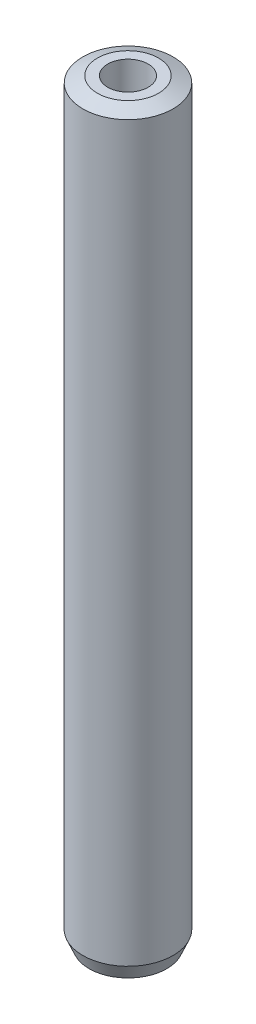
ISO-10303-21;
HEADER;
FILE_DESCRIPTION(('STEP AP214'),'2;1');
FILE_NAME('part.step','',(''),(''),'','','');
FILE_SCHEMA(('AUTOMOTIVE_DESIGN { 1 0 10303 214 1 1 1 1 }'));
ENDSEC;
DATA;
#1=APPLICATION_CONTEXT('core data for automotive mechanical design processes');
#2=APPLICATION_PROTOCOL_DEFINITION('international standard','automotive_design',2000,#1);
#3=PRODUCT_CONTEXT('',#1,'mechanical');
#4=PRODUCT('Part','Part','',(#3));
#5=PRODUCT_RELATED_PRODUCT_CATEGORY('part','',(#4));
#6=PRODUCT_DEFINITION_FORMATION('','',#4);
#7=PRODUCT_DEFINITION_CONTEXT('part definition',#1,'design');
#8=PRODUCT_DEFINITION('design','',#6,#7);
#9=PRODUCT_DEFINITION_SHAPE('','',#8);
#10=(LENGTH_UNIT() NAMED_UNIT(*) SI_UNIT(.MILLI.,.METRE.));
#11=(NAMED_UNIT(*) PLANE_ANGLE_UNIT() SI_UNIT($,.RADIAN.));
#12=(NAMED_UNIT(*) SI_UNIT($,.STERADIAN.) SOLID_ANGLE_UNIT());
#13=UNCERTAINTY_MEASURE_WITH_UNIT(LENGTH_MEASURE(1.E-05),#10,'distance_accuracy_value','');
#14=(GEOMETRIC_REPRESENTATION_CONTEXT(3) GLOBAL_UNCERTAINTY_ASSIGNED_CONTEXT((#13)) GLOBAL_UNIT_ASSIGNED_CONTEXT((#10,
#11,#12)) REPRESENTATION_CONTEXT('',''));
#15=CARTESIAN_POINT('',(0.,0.,0.));
#16=DIRECTION('',(0.,0.,1.));
#17=DIRECTION('',(1.,0.,0.));
#18=AXIS2_PLACEMENT_3D('',#15,#16,#17);
#19=CARTESIAN_POINT('',(0.,501.28639666988,0.));
#20=DIRECTION('',(0.,-1.,0.));
#21=DIRECTION('',(0.,0.,-1.));
#22=AXIS2_PLACEMENT_3D('',#19,#20,#21);
#23=CYLINDRICAL_SURFACE('',#22,30.);
#24=CARTESIAN_POINT('',(0.,497.144954889801,0.));
#25=DIRECTION('',(0.,1.,0.));
#26=DIRECTION('',(0.,0.,1.));
#27=AXIS2_PLACEMENT_3D('',#24,#25,#26);
#28=CIRCLE('',#27,30.);
#29=CARTESIAN_POINT('',(0.,497.144954889801,30.));
#30=VERTEX_POINT('',#29);
#31=EDGE_CURVE('E50',#30,#30,#28,.F.);
#32=ORIENTED_EDGE('',*,*,#31,.T.);
#33=EDGE_LOOP('',(#32));
#34=FACE_BOUND('',#33,.T.);
#35=CARTESIAN_POINT('',(0.,9.67848338552152,0.));
#36=DIRECTION('',(0.,1.,0.));
#37=DIRECTION('',(0.,0.,1.));
#38=AXIS2_PLACEMENT_3D('',#35,#36,#37);
#39=CIRCLE('',#38,30.);
#40=CARTESIAN_POINT('',(0.,9.67848338552152,30.));
#41=VERTEX_POINT('',#40);
#42=EDGE_CURVE('E51',#41,#41,#39,.T.);
#43=ORIENTED_EDGE('',*,*,#42,.T.);
#44=EDGE_LOOP('',(#43));
#45=FACE_BOUND('',#44,.T.);
#46=ADVANCED_FACE('F39',(#34,#45),#23,.T.);
#47=CARTESIAN_POINT('',(0.,501.28639666988,0.));
#48=DIRECTION('',(0.,1.,0.));
#49=DIRECTION('',(0.,0.,1.));
#50=AXIS2_PLACEMENT_3D('',#47,#48,#49);
#51=PLANE('',#50);
#52=CARTESIAN_POINT('',(0.,501.28639666988,0.));
#53=DIRECTION('',(0.,1.,0.));
#54=DIRECTION('',(0.,0.,1.));
#55=AXIS2_PLACEMENT_3D('',#52,#53,#54);
#56=CIRCLE('',#55,20.3215166144782);
#57=CARTESIAN_POINT('',(0.,501.28639666988,20.3215166144782));
#58=VERTEX_POINT('',#57);
#59=EDGE_CURVE('E54',#58,#58,#56,.T.);
#60=ORIENTED_EDGE('',*,*,#59,.T.);
#61=EDGE_LOOP('',(#60));
#62=FACE_BOUND('',#61,.T.);
#63=CARTESIAN_POINT('',(0.,501.28639666988,0.));
#64=DIRECTION('',(0.,1.,0.));
#65=DIRECTION('',(0.,0.,1.));
#66=AXIS2_PLACEMENT_3D('',#63,#64,#65);
#67=CIRCLE('',#66,13.4355536161411);
#68=CARTESIAN_POINT('',(0.,501.28639666988,13.4355536161411));
#69=VERTEX_POINT('',#68);
#70=EDGE_CURVE('E58',#69,#69,#67,.T.);
#71=ORIENTED_EDGE('',*,*,#70,.F.);
#72=EDGE_LOOP('',(#71));
#73=FACE_BOUND('',#72,.T.);
#74=ADVANCED_FACE('F69',(#62,#73),#51,.T.);
#75=CARTESIAN_POINT('',(0.,0.,0.));
#76=DIRECTION('',(0.,1.,0.));
#77=DIRECTION('',(0.,0.,1.));
#78=AXIS2_PLACEMENT_3D('',#75,#76,#77);
#79=PLANE('',#78);
#80=CARTESIAN_POINT('',(0.,0.,0.));
#81=DIRECTION('',(0.,1.,0.));
#82=DIRECTION('',(0.,0.,1.));
#83=AXIS2_PLACEMENT_3D('',#80,#81,#82);
#84=CIRCLE('',#83,25.8585582199218);
#85=CARTESIAN_POINT('',(0.,0.,25.8585582199218));
#86=VERTEX_POINT('',#85);
#87=EDGE_CURVE('E10',#86,#86,#84,.F.);
#88=ORIENTED_EDGE('',*,*,#87,.T.);
#89=EDGE_LOOP('',(#88));
#90=FACE_BOUND('',#89,.T.);
#91=CARTESIAN_POINT('',(0.,0.,0.));
#92=DIRECTION('',(0.,1.,0.));
#93=DIRECTION('',(0.,0.,1.));
#94=AXIS2_PLACEMENT_3D('',#91,#92,#93);
#95=CIRCLE('',#94,13.4355536161411);
#96=CARTESIAN_POINT('',(0.,0.,13.4355536161411));
#97=VERTEX_POINT('',#96);
#98=EDGE_CURVE('E63',#97,#97,#95,.T.);
#99=ORIENTED_EDGE('',*,*,#98,.T.);
#100=EDGE_LOOP('',(#99));
#101=FACE_BOUND('',#100,.T.);
#102=ADVANCED_FACE('F75',(#90,#101),#79,.F.);
#103=CARTESIAN_POINT('',(0.,501.28639666988,0.));
#104=DIRECTION('',(0.,-1.,0.));
#105=DIRECTION('',(0.,0.,-1.));
#106=AXIS2_PLACEMENT_3D('',#103,#104,#105);
#107=CYLINDRICAL_SURFACE('',#106,13.4355536161411);
#108=ORIENTED_EDGE('',*,*,#70,.T.);
#109=EDGE_LOOP('',(#108));
#110=FACE_BOUND('',#109,.T.);
#111=ORIENTED_EDGE('',*,*,#98,.F.);
#112=EDGE_LOOP('',(#111));
#113=FACE_BOUND('',#112,.T.);
#114=ADVANCED_FACE('F70',(#110,#113),#107,.F.);
#115=CARTESIAN_POINT('',(0.,501.28639666988,0.));
#116=DIRECTION('',(0.,-1.,0.));
#117=DIRECTION('',(0.,0.,-1.));
#118=AXIS2_PLACEMENT_3D('',#115,#116,#117);
#119=CONICAL_SURFACE('',#118,20.3215166144782,1.16647028321676);
#120=ORIENTED_EDGE('',*,*,#31,.F.);
#121=EDGE_LOOP('',(#120));
#122=FACE_BOUND('',#121,.T.);
#123=ORIENTED_EDGE('',*,*,#59,.F.);
#124=EDGE_LOOP('',(#123));
#125=FACE_BOUND('',#124,.T.);
#126=ADVANCED_FACE('F81',(#122,#125),#119,.T.);
#127=CARTESIAN_POINT('',(0.,9.67848338552152,0.));
#128=DIRECTION('',(0.,1.,0.));
#129=DIRECTION('',(0.,0.,1.));
#130=AXIS2_PLACEMENT_3D('',#127,#128,#129);
#131=CONICAL_SURFACE('',#130,30.,0.404326043578133);
#132=CARTESIAN_POINT('',(0.,0.,25.8585582199218));
#133=CARTESIAN_POINT('',(0.,0.100817535265848,25.9016982384643));
#134=CARTESIAN_POINT('',(0.,0.201635070531697,25.9448382570067));
#135=CARTESIAN_POINT('',(0.,0.403270141063395,26.0311182940917));
#136=CARTESIAN_POINT('',(0.,0.504087676329244,26.0742583126342));
#137=CARTESIAN_POINT('',(0.,0.705722746860942,26.1605383497191));
#138=CARTESIAN_POINT('',(0.,0.806540282126791,26.2036783682616));
#139=CARTESIAN_POINT('',(0.,1.00817535265849,26.2899584053466));
#140=CARTESIAN_POINT('',(0.,1.10899288792434,26.3330984238891));
#141=CARTESIAN_POINT('',(0.,1.31062795845604,26.419378460974));
#142=CARTESIAN_POINT('',(0.,1.41144549372189,26.4625184795165));
#143=CARTESIAN_POINT('',(0.,1.61308056425358,26.5487985166015));
#144=CARTESIAN_POINT('',(0.,1.71389809951943,26.591938535144));
#145=CARTESIAN_POINT('',(0.,1.91553317005113,26.6782185722289));
#146=CARTESIAN_POINT('',(0.,2.01635070531698,26.7213585907714));
#147=CARTESIAN_POINT('',(0.,2.21798577584868,26.8076386278564));
#148=CARTESIAN_POINT('',(0.,2.31880331111453,26.8507786463989));
#149=CARTESIAN_POINT('',(0.,2.52043838164623,26.9370586834838));
#150=CARTESIAN_POINT('',(0.,2.62125591691208,26.9801987020263));
#151=CARTESIAN_POINT('',(0.,2.82289098744377,27.0664787391113));
#152=CARTESIAN_POINT('',(0.,2.92370852270962,27.1096187576537));
#153=CARTESIAN_POINT('',(0.,3.12534359324132,27.1958987947387));
#154=CARTESIAN_POINT('',(0.,3.22616112850717,27.2390388132812));
#155=CARTESIAN_POINT('',(0.,3.42779619903887,27.3253188503661));
#156=CARTESIAN_POINT('',(0.,3.52861373430472,27.3684588689086));
#157=CARTESIAN_POINT('',(0.,3.73024880483642,27.4547389059936));
#158=CARTESIAN_POINT('',(0.,3.83106634010227,27.4978789245361));
#159=CARTESIAN_POINT('',(0.,4.03270141063397,27.584158961621));
#160=CARTESIAN_POINT('',(0.,4.13351894589981,27.6272989801635));
#161=CARTESIAN_POINT('',(0.,4.33515401643151,27.7135790172485));
#162=CARTESIAN_POINT('',(0.,4.43597155169736,27.756719035791));
#163=CARTESIAN_POINT('',(0.,4.63760662222906,27.8429990728759));
#164=CARTESIAN_POINT('',(0.,4.73842415749491,27.8861390914184));
#165=CARTESIAN_POINT('',(0.,4.94005922802661,27.9724191285034));
#166=CARTESIAN_POINT('',(0.,5.04087676329246,28.0155591470459));
#167=CARTESIAN_POINT('',(0.,5.24251183382415,28.1018391841308));
#168=CARTESIAN_POINT('',(0.,5.34332936909001,28.1449792026733));
#169=CARTESIAN_POINT('',(0.,5.5449644396217,28.2312592397583));
#170=CARTESIAN_POINT('',(0.,5.64578197488755,28.2743992583007));
#171=CARTESIAN_POINT('',(0.,5.84741704541925,28.3606792953857));
#172=CARTESIAN_POINT('',(0.,5.9482345806851,28.4038193139282));
#173=CARTESIAN_POINT('',(0.,6.1498696512168,28.4900993510131));
#174=CARTESIAN_POINT('',(0.,6.25068718648265,28.5332393695556));
#175=CARTESIAN_POINT('',(0.,6.45232225701435,28.6195194066406));
#176=CARTESIAN_POINT('',(0.,6.5531397922802,28.6626594251831));
#177=CARTESIAN_POINT('',(0.,6.75477486281189,28.748939462268));
#178=CARTESIAN_POINT('',(0.,6.85559239807774,28.7920794808105));
#179=CARTESIAN_POINT('',(0.,7.05722746860944,28.8783595178955));
#180=CARTESIAN_POINT('',(0.,7.15804500387529,28.921499536438));
#181=CARTESIAN_POINT('',(0.,7.35968007440699,29.0077795735229));
#182=CARTESIAN_POINT('',(0.,7.46049760967284,29.0509195920654));
#183=CARTESIAN_POINT('',(0.,7.66213268020454,29.1371996291504));
#184=CARTESIAN_POINT('',(0.,7.76295021547038,29.1803396476929));
#185=CARTESIAN_POINT('',(0.,7.96458528600208,29.2666196847778));
#186=CARTESIAN_POINT('',(0.,8.06540282126793,29.3097597033203));
#187=CARTESIAN_POINT('',(0.,8.26703789179963,29.3960397404053));
#188=CARTESIAN_POINT('',(0.,8.36785542706548,29.4391797589477));
#189=CARTESIAN_POINT('',(0.,8.56949049759718,29.5254597960327));
#190=CARTESIAN_POINT('',(0.,8.67030803286303,29.5685998145752));
#191=CARTESIAN_POINT('',(0.,8.87194310339473,29.6548798516601));
#192=CARTESIAN_POINT('',(0.,8.97276063866058,29.6980198702026));
#193=CARTESIAN_POINT('',(0.,9.17439570919227,29.7842999072876));
#194=CARTESIAN_POINT('',(0.,9.27521324445812,29.8274399258301));
#195=CARTESIAN_POINT('',(0.,9.47684831498982,29.913719962915));
#196=CARTESIAN_POINT('',(0.,9.57766585025567,29.9568599814575));
#197=CARTESIAN_POINT('',(0.,9.67848338552152,30.));
#198=B_SPLINE_CURVE_WITH_KNOTS('',3,(#132,#133,#134,#135,#136,#137,#138,#139,#140,#141,#142,
#143,#144,#145,#146,#147,#148,#149,#150,#151,#152,#153,#154,#155,#156,#157,#158,#159,#160,#161,
#162,#163,#164,#165,#166,#167,#168,#169,#170,#171,#172,#173,#174,#175,#176,#177,#178,#179,#180,
#181,#182,#183,#184,#185,#186,#187,#188,#189,#190,#191,#192,#193,#194,#195,#196,#197),
.UNSPECIFIED.,.F.,.F.,(4,2,2,2,2,2,2,2,2,2,2,2,2,2,2,2,2,2,2,2,2,2,2,2,2,2,2,2,2,2,2,2,4),(0.,
0.328978919616952,0.657957839233905,0.986936758850858,1.31591567846781,1.64489459808476,
1.97387351770172,2.30285243731867,2.63183135693562,2.96081027655257,3.28978919616953,
3.61876811578648,3.94774703540343,4.27672595502039,4.60570487463734,4.93468379425429,
5.26366271387124,5.5926416334882,5.92162055310515,6.2505994727221,6.57957839233905,
6.90855731195601,7.23753623157296,7.56651515118991,7.89549407080687,8.22447299042382,
8.55345191004077,8.88243082965772,9.21140974927468,9.54038866889163,9.86936758850858,
10.1983465081255,10.5273254277425),.UNSPECIFIED.);
#199=EDGE_CURVE('BSEAM45',#86,#41,#198,.T.);
#200=ORIENTED_EDGE('',*,*,#87,.F.);
#201=ORIENTED_EDGE('',*,*,#42,.F.);
#202=ORIENTED_EDGE('',*,*,#199,.T.);
#203=ORIENTED_EDGE('',*,*,#199,.F.);
#204=EDGE_LOOP('',(#200,#202,#201,#203));
#205=FACE_BOUND('',#204,.T.);
#206=ADVANCED_FACE('F45',(#205),#131,.T.);
#207=CLOSED_SHELL('',(#46,#74,#102,#114,#126,#206));
#208=MANIFOLD_SOLID_BREP('B2',#207);
#209=ADVANCED_BREP_SHAPE_REPRESENTATION('',(#18,#208),#14);
#210=SHAPE_DEFINITION_REPRESENTATION(#9,#209);
ENDSEC;
END-ISO-10303-21;
